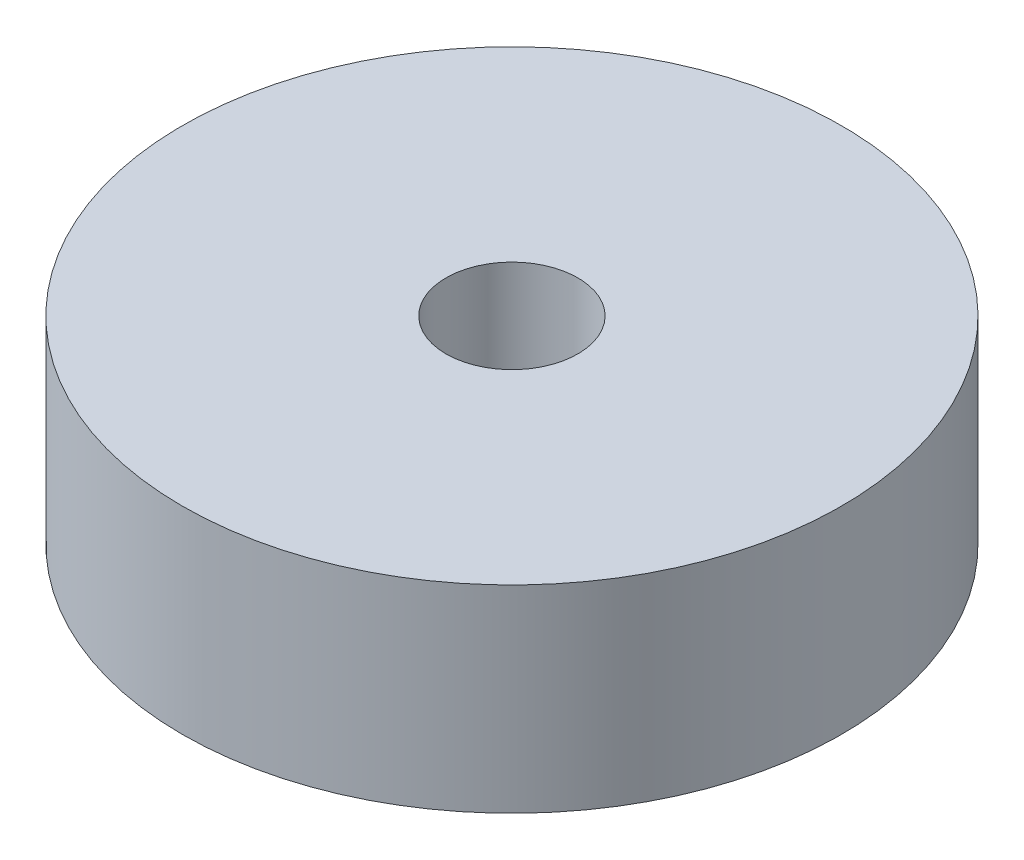
ISO-10303-21;
HEADER;
FILE_DESCRIPTION(('STEP AP214'),'2;1');
FILE_NAME('part.step','',(''),(''),'','','');
FILE_SCHEMA(('AUTOMOTIVE_DESIGN { 1 0 10303 214 1 1 1 1 }'));
ENDSEC;
DATA;
#1=APPLICATION_CONTEXT('core data for automotive mechanical design processes');
#2=APPLICATION_PROTOCOL_DEFINITION('international standard','automotive_design',2000,#1);
#3=PRODUCT_CONTEXT('',#1,'mechanical');
#4=PRODUCT('Part','Part','',(#3));
#5=PRODUCT_RELATED_PRODUCT_CATEGORY('part','',(#4));
#6=PRODUCT_DEFINITION_FORMATION('','',#4);
#7=PRODUCT_DEFINITION_CONTEXT('part definition',#1,'design');
#8=PRODUCT_DEFINITION('design','',#6,#7);
#9=PRODUCT_DEFINITION_SHAPE('','',#8);
#10=(LENGTH_UNIT() NAMED_UNIT(*) SI_UNIT(.MILLI.,.METRE.));
#11=(NAMED_UNIT(*) PLANE_ANGLE_UNIT() SI_UNIT($,.RADIAN.));
#12=(NAMED_UNIT(*) SI_UNIT($,.STERADIAN.) SOLID_ANGLE_UNIT());
#13=UNCERTAINTY_MEASURE_WITH_UNIT(LENGTH_MEASURE(1.E-05),#10,'distance_accuracy_value','');
#14=(GEOMETRIC_REPRESENTATION_CONTEXT(3) GLOBAL_UNCERTAINTY_ASSIGNED_CONTEXT((#13)) GLOBAL_UNIT_ASSIGNED_CONTEXT((#10,
#11,#12)) REPRESENTATION_CONTEXT('',''));
#15=CARTESIAN_POINT('',(0.,0.,0.));
#16=DIRECTION('',(0.,0.,1.));
#17=DIRECTION('',(1.,0.,0.));
#18=AXIS2_PLACEMENT_3D('',#15,#16,#17);
#19=CARTESIAN_POINT('',(0.,6.,0.));
#20=DIRECTION('',(0.,1.,0.));
#21=DIRECTION('',(0.,0.,1.));
#22=AXIS2_PLACEMENT_3D('',#19,#20,#21);
#23=PLANE('',#22);
#24=CARTESIAN_POINT('',(0.,6.,0.));
#25=DIRECTION('',(0.,1.,0.));
#26=DIRECTION('',(0.,0.,1.));
#27=AXIS2_PLACEMENT_3D('',#24,#25,#26);
#28=CIRCLE('',#27,10.);
#29=CARTESIAN_POINT('',(0.,6.,10.));
#30=VERTEX_POINT('',#29);
#31=EDGE_CURVE('E10',#30,#30,#28,.T.);
#32=ORIENTED_EDGE('',*,*,#31,.T.);
#33=EDGE_LOOP('',(#32));
#34=FACE_BOUND('',#33,.T.);
#35=CARTESIAN_POINT('',(0.,6.,0.));
#36=DIRECTION('',(0.,1.,0.));
#37=DIRECTION('',(0.,0.,1.));
#38=AXIS2_PLACEMENT_3D('',#35,#36,#37);
#39=CIRCLE('',#38,2.);
#40=CARTESIAN_POINT('',(0.,6.,2.));
#41=VERTEX_POINT('',#40);
#42=EDGE_CURVE('E42',#41,#41,#39,.T.);
#43=ORIENTED_EDGE('',*,*,#42,.F.);
#44=EDGE_LOOP('',(#43));
#45=FACE_BOUND('',#44,.T.);
#46=ADVANCED_FACE('F31',(#34,#45),#23,.T.);
#47=CARTESIAN_POINT('',(0.,0.,0.));
#48=DIRECTION('',(0.,1.,0.));
#49=DIRECTION('',(0.,0.,1.));
#50=AXIS2_PLACEMENT_3D('',#47,#48,#49);
#51=PLANE('',#50);
#52=CARTESIAN_POINT('',(0.,0.,0.));
#53=DIRECTION('',(0.,1.,0.));
#54=DIRECTION('',(0.,0.,1.));
#55=AXIS2_PLACEMENT_3D('',#52,#53,#54);
#56=CIRCLE('',#55,10.);
#57=CARTESIAN_POINT('',(0.,0.,10.));
#58=VERTEX_POINT('',#57);
#59=EDGE_CURVE('E35',#58,#58,#56,.T.);
#60=ORIENTED_EDGE('',*,*,#59,.F.);
#61=EDGE_LOOP('',(#60));
#62=FACE_BOUND('',#61,.T.);
#63=CARTESIAN_POINT('',(0.,0.,0.));
#64=DIRECTION('',(0.,1.,0.));
#65=DIRECTION('',(0.,0.,1.));
#66=AXIS2_PLACEMENT_3D('',#63,#64,#65);
#67=CIRCLE('',#66,2.);
#68=CARTESIAN_POINT('',(0.,0.,2.));
#69=VERTEX_POINT('',#68);
#70=EDGE_CURVE('E44',#69,#69,#67,.T.);
#71=ORIENTED_EDGE('',*,*,#70,.T.);
#72=EDGE_LOOP('',(#71));
#73=FACE_BOUND('',#72,.T.);
#74=ADVANCED_FACE('F54',(#62,#73),#51,.F.);
#75=CARTESIAN_POINT('',(0.,6.,0.));
#76=DIRECTION('',(0.,-1.,0.));
#77=DIRECTION('',(0.,0.,-1.));
#78=AXIS2_PLACEMENT_3D('',#75,#76,#77);
#79=CYLINDRICAL_SURFACE('',#78,10.);
#80=ORIENTED_EDGE('',*,*,#31,.F.);
#81=EDGE_LOOP('',(#80));
#82=FACE_BOUND('',#81,.T.);
#83=ORIENTED_EDGE('',*,*,#59,.T.);
#84=EDGE_LOOP('',(#83));
#85=FACE_BOUND('',#84,.T.);
#86=ADVANCED_FACE('F33',(#82,#85),#79,.T.);
#87=CARTESIAN_POINT('',(0.,6.,0.));
#88=DIRECTION('',(0.,-1.,0.));
#89=DIRECTION('',(0.,0.,-1.));
#90=AXIS2_PLACEMENT_3D('',#87,#88,#89);
#91=CYLINDRICAL_SURFACE('',#90,2.);
#92=ORIENTED_EDGE('',*,*,#42,.T.);
#93=EDGE_LOOP('',(#92));
#94=FACE_BOUND('',#93,.T.);
#95=ORIENTED_EDGE('',*,*,#70,.F.);
#96=EDGE_LOOP('',(#95));
#97=FACE_BOUND('',#96,.T.);
#98=ADVANCED_FACE('F50',(#94,#97),#91,.F.);
#99=CLOSED_SHELL('',(#46,#74,#86,#98));
#100=MANIFOLD_SOLID_BREP('B2',#99);
#101=ADVANCED_BREP_SHAPE_REPRESENTATION('',(#18,#100),#14);
#102=SHAPE_DEFINITION_REPRESENTATION(#9,#101);
ENDSEC;
END-ISO-10303-21;
